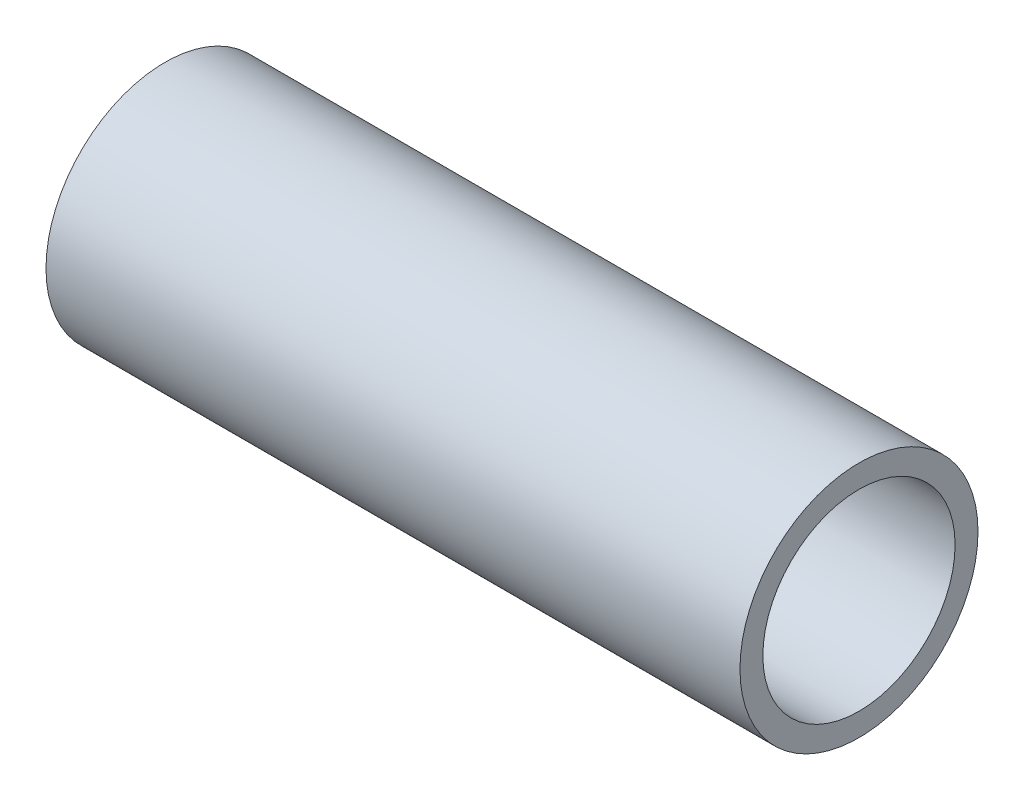
ISO-10303-21;
HEADER;
FILE_DESCRIPTION(('STEP AP214'),'2;1');
FILE_NAME('part.step','',(''),(''),'','','');
FILE_SCHEMA(('AUTOMOTIVE_DESIGN { 1 0 10303 214 1 1 1 1 }'));
ENDSEC;
DATA;
#1=APPLICATION_CONTEXT('core data for automotive mechanical design processes');
#2=APPLICATION_PROTOCOL_DEFINITION('international standard','automotive_design',2000,#1);
#3=PRODUCT_CONTEXT('',#1,'mechanical');
#4=PRODUCT('Part','Part','',(#3));
#5=PRODUCT_RELATED_PRODUCT_CATEGORY('part','',(#4));
#6=PRODUCT_DEFINITION_FORMATION('','',#4);
#7=PRODUCT_DEFINITION_CONTEXT('part definition',#1,'design');
#8=PRODUCT_DEFINITION('design','',#6,#7);
#9=PRODUCT_DEFINITION_SHAPE('','',#8);
#10=(LENGTH_UNIT() NAMED_UNIT(*) SI_UNIT(.MILLI.,.METRE.));
#11=(NAMED_UNIT(*) PLANE_ANGLE_UNIT() SI_UNIT($,.RADIAN.));
#12=(NAMED_UNIT(*) SI_UNIT($,.STERADIAN.) SOLID_ANGLE_UNIT());
#13=UNCERTAINTY_MEASURE_WITH_UNIT(LENGTH_MEASURE(1.E-05),#10,'distance_accuracy_value','');
#14=(GEOMETRIC_REPRESENTATION_CONTEXT(3) GLOBAL_UNCERTAINTY_ASSIGNED_CONTEXT((#13)) GLOBAL_UNIT_ASSIGNED_CONTEXT((#10,
#11,#12)) REPRESENTATION_CONTEXT('',''));
#15=CARTESIAN_POINT('',(0.,0.,0.));
#16=DIRECTION('',(0.,0.,1.));
#17=DIRECTION('',(1.,0.,0.));
#18=AXIS2_PLACEMENT_3D('',#15,#16,#17);
#19=CARTESIAN_POINT('',(28.8798,0.,0.));
#20=DIRECTION('',(-1.,0.,0.));
#21=DIRECTION('',(0.,0.,1.));
#22=AXIS2_PLACEMENT_3D('',#19,#20,#21);
#23=CYLINDRICAL_SURFACE('',#22,4.);
#24=CARTESIAN_POINT('',(0.,0.,0.));
#25=DIRECTION('',(-1.,0.,0.));
#26=DIRECTION('',(0.,0.,1.));
#27=AXIS2_PLACEMENT_3D('',#24,#25,#26);
#28=CIRCLE('',#27,4.);
#29=CARTESIAN_POINT('',(0.,0.,4.));
#30=VERTEX_POINT('',#29);
#31=EDGE_CURVE('E26',#30,#30,#28,.T.);
#32=ORIENTED_EDGE('',*,*,#31,.T.);
#33=EDGE_LOOP('',(#32));
#34=FACE_BOUND('',#33,.T.);
#35=CARTESIAN_POINT('',(28.8798,0.,0.));
#36=DIRECTION('',(-1.,0.,0.));
#37=DIRECTION('',(0.,0.,1.));
#38=AXIS2_PLACEMENT_3D('',#35,#36,#37);
#39=CIRCLE('',#38,4.);
#40=CARTESIAN_POINT('',(28.8798,0.,4.));
#41=VERTEX_POINT('',#40);
#42=EDGE_CURVE('E17',#41,#41,#39,.T.);
#43=ORIENTED_EDGE('',*,*,#42,.F.);
#44=EDGE_LOOP('',(#43));
#45=FACE_BOUND('',#44,.T.);
#46=ADVANCED_FACE('F14',(#34,#45),#23,.F.);
#47=CARTESIAN_POINT('',(28.8798,0.,0.));
#48=DIRECTION('',(1.,0.,0.));
#49=DIRECTION('',(0.,0.,-1.));
#50=AXIS2_PLACEMENT_3D('',#47,#48,#49);
#51=PLANE('',#50);
#52=ORIENTED_EDGE('',*,*,#42,.T.);
#53=EDGE_LOOP('',(#52));
#54=FACE_BOUND('',#53,.T.);
#55=CARTESIAN_POINT('',(28.8798,0.,0.));
#56=DIRECTION('',(-1.,0.,0.));
#57=DIRECTION('',(0.,0.,1.));
#58=AXIS2_PLACEMENT_3D('',#55,#56,#57);
#59=CIRCLE('',#58,4.953);
#60=CARTESIAN_POINT('',(28.8798,0.,4.953));
#61=VERTEX_POINT('',#60);
#62=EDGE_CURVE('E21',#61,#61,#59,.T.);
#63=ORIENTED_EDGE('',*,*,#62,.F.);
#64=EDGE_LOOP('',(#63));
#65=FACE_BOUND('',#64,.T.);
#66=ADVANCED_FACE('F34',(#54,#65),#51,.T.);
#67=CARTESIAN_POINT('',(0.,0.,0.));
#68=DIRECTION('',(1.,0.,0.));
#69=DIRECTION('',(0.,0.,-1.));
#70=AXIS2_PLACEMENT_3D('',#67,#68,#69);
#71=PLANE('',#70);
#72=ORIENTED_EDGE('',*,*,#31,.F.);
#73=EDGE_LOOP('',(#72));
#74=FACE_BOUND('',#73,.T.);
#75=CARTESIAN_POINT('',(0.,0.,0.));
#76=DIRECTION('',(-1.,0.,0.));
#77=DIRECTION('',(0.,0.,1.));
#78=AXIS2_PLACEMENT_3D('',#75,#76,#77);
#79=CIRCLE('',#78,4.953);
#80=CARTESIAN_POINT('',(0.,0.,4.953));
#81=VERTEX_POINT('',#80);
#82=EDGE_CURVE('E10',#81,#81,#79,.F.);
#83=ORIENTED_EDGE('',*,*,#82,.F.);
#84=EDGE_LOOP('',(#83));
#85=FACE_BOUND('',#84,.T.);
#86=ADVANCED_FACE('F42',(#74,#85),#71,.F.);
#87=CARTESIAN_POINT('',(28.8798,0.,0.));
#88=DIRECTION('',(-1.,0.,0.));
#89=DIRECTION('',(0.,0.,1.));
#90=AXIS2_PLACEMENT_3D('',#87,#88,#89);
#91=CYLINDRICAL_SURFACE('',#90,4.953);
#92=ORIENTED_EDGE('',*,*,#82,.T.);
#93=EDGE_LOOP('',(#92));
#94=FACE_BOUND('',#93,.T.);
#95=ORIENTED_EDGE('',*,*,#62,.T.);
#96=EDGE_LOOP('',(#95));
#97=FACE_BOUND('',#96,.T.);
#98=ADVANCED_FACE('F43',(#94,#97),#91,.T.);
#99=CLOSED_SHELL('',(#46,#66,#86,#98));
#100=MANIFOLD_SOLID_BREP('B1',#99);
#101=ADVANCED_BREP_SHAPE_REPRESENTATION('',(#18,#100),#14);
#102=SHAPE_DEFINITION_REPRESENTATION(#9,#101);
ENDSEC;
END-ISO-10303-21;
